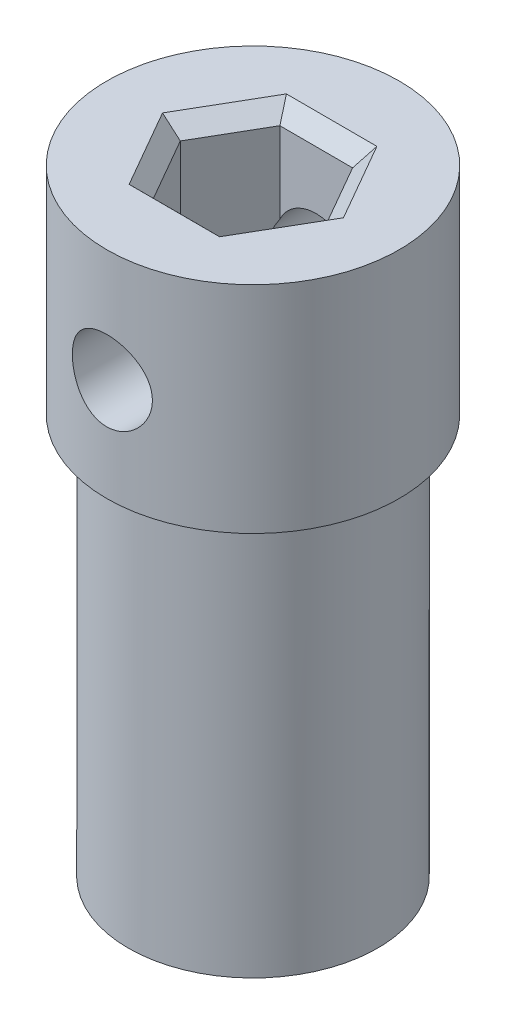
ISO-10303-21;
HEADER;
FILE_DESCRIPTION(('STEP AP214'),'2;1');
FILE_NAME('part.step','',(''),(''),'','','');
FILE_SCHEMA(('AUTOMOTIVE_DESIGN { 1 0 10303 214 1 1 1 1 }'));
ENDSEC;
DATA;
#1=APPLICATION_CONTEXT('core data for automotive mechanical design processes');
#2=APPLICATION_PROTOCOL_DEFINITION('international standard','automotive_design',2000,#1);
#3=PRODUCT_CONTEXT('',#1,'mechanical');
#4=PRODUCT('Part','Part','',(#3));
#5=PRODUCT_RELATED_PRODUCT_CATEGORY('part','',(#4));
#6=PRODUCT_DEFINITION_FORMATION('','',#4);
#7=PRODUCT_DEFINITION_CONTEXT('part definition',#1,'design');
#8=PRODUCT_DEFINITION('design','',#6,#7);
#9=PRODUCT_DEFINITION_SHAPE('','',#8);
#10=(LENGTH_UNIT() NAMED_UNIT(*) SI_UNIT(.MILLI.,.METRE.));
#11=(NAMED_UNIT(*) PLANE_ANGLE_UNIT() SI_UNIT($,.RADIAN.));
#12=(NAMED_UNIT(*) SI_UNIT($,.STERADIAN.) SOLID_ANGLE_UNIT());
#13=UNCERTAINTY_MEASURE_WITH_UNIT(LENGTH_MEASURE(1.E-05),#10,'distance_accuracy_value','');
#14=(GEOMETRIC_REPRESENTATION_CONTEXT(3) GLOBAL_UNCERTAINTY_ASSIGNED_CONTEXT((#13)) GLOBAL_UNIT_ASSIGNED_CONTEXT((#10,
#11,#12)) REPRESENTATION_CONTEXT('',''));
#15=CARTESIAN_POINT('',(0.,0.,0.));
#16=DIRECTION('',(0.,0.,1.));
#17=DIRECTION('',(1.,0.,0.));
#18=AXIS2_PLACEMENT_3D('',#15,#16,#17);
#19=CARTESIAN_POINT('',(1.18786890623597,20.,-2.04751087785415));
#20=DIRECTION('',(-0.00209924990421611,0.,0.999997796572492));
#21=DIRECTION('',(0.999997796572492,0.,0.00209924990421611));
#22=AXIS2_PLACEMENT_3D('',#19,#20,#21);
#23=PLANE('',#22);
#24=CARTESIAN_POINT('',(0.,16.3191525657327,-2.05000451703634));
#25=DIRECTION('',(-0.00209924990421611,0.,0.999997796572492));
#26=DIRECTION('',(-0.999997796572492,0.,-0.00209924990421611));
#27=AXIS2_PLACEMENT_3D('',#24,#25,#26);
#28=ELLIPSE('',#27,1.30000286446207,1.3);
#29=CARTESIAN_POINT('',(-1.17926198162869,15.7720317576059,-2.05248008809306));
#30=VERTEX_POINT('',#29);
#31=CARTESIAN_POINT('',(1.18786890623597,15.7909788617321,-2.04751087785415));
#32=VERTEX_POINT('',#31);
#33=EDGE_CURVE('E292',#30,#32,#28,.T.);
#34=ORIENTED_EDGE('',*,*,#33,.F.);
#35=DIRECTION('',(0.,-1.,0.));
#36=VECTOR('',#35,1.);
#37=CARTESIAN_POINT('',(-1.17926198162869,20.,-2.05248008809306));
#38=LINE('',#37,#36);
#39=CARTESIAN_POINT('',(-1.17926198162869,5.,-2.05248008809306));
#40=VERTEX_POINT('',#39);
#41=EDGE_CURVE('E180',#30,#40,#38,.T.);
#42=ORIENTED_EDGE('',*,*,#41,.T.);
#43=DIRECTION('',(-0.999997796572492,0.,-0.00209924990421611));
#44=VECTOR('',#43,1.);
#45=CARTESIAN_POINT('',(0.00430346230364303,5.,-2.04999548297361));
#46=LINE('',#45,#44);
#47=CARTESIAN_POINT('',(1.18786890623597,5.,-2.04751087785415));
#48=VERTEX_POINT('',#47);
#49=EDGE_CURVE('E171',#48,#40,#46,.T.);
#50=ORIENTED_EDGE('',*,*,#49,.F.);
#51=DIRECTION('',(0.,-1.,0.));
#52=VECTOR('',#51,1.);
#53=CARTESIAN_POINT('',(1.18786890623597,20.,-2.04751087785415));
#54=LINE('',#53,#52);
#55=EDGE_CURVE('E184',#32,#48,#54,.T.);
#56=ORIENTED_EDGE('',*,*,#55,.F.);
#57=EDGE_LOOP('',(#34,#42,#50,#56));
#58=FACE_BOUND('',#57,.T.);
#59=ADVANCED_FACE('F47',(#58),#23,.T.);
#60=CARTESIAN_POINT('',(-1.18786890623597,20.,2.04751087785415));
#61=DIRECTION('',(0.00209924990421593,0.,-0.999997796572492));
#62=DIRECTION('',(-0.999997796572492,0.,-0.00209924990421593));
#63=AXIS2_PLACEMENT_3D('',#60,#61,#62);
#64=PLANE('',#63);
#65=CARTESIAN_POINT('',(0.,16.3191525657327,2.05000451703634));
#66=DIRECTION('',(0.00209924990421593,0.,-0.999997796572492));
#67=DIRECTION('',(-0.999997796572492,0.,-0.00209924990421593));
#68=AXIS2_PLACEMENT_3D('',#65,#66,#67);
#69=ELLIPSE('',#68,1.30000286446207,1.3);
#70=CARTESIAN_POINT('',(-1.18786890623597,16.8473262697334,2.04751087785415));
#71=VERTEX_POINT('',#70);
#72=CARTESIAN_POINT('',(1.17926198162869,16.8662733738592,2.05248008809306));
#73=VERTEX_POINT('',#72);
#74=EDGE_CURVE('E76',#71,#73,#69,.T.);
#75=ORIENTED_EDGE('',*,*,#74,.F.);
#76=DIRECTION('',(0.,-1.,0.));
#77=VECTOR('',#76,1.);
#78=CARTESIAN_POINT('',(-1.18786890623597,20.,2.04751087785415));
#79=LINE('',#78,#77);
#80=CARTESIAN_POINT('',(-1.18786890623597,19.5,2.04751087785415));
#81=VERTEX_POINT('',#80);
#82=EDGE_CURVE('E175',#81,#71,#79,.T.);
#83=ORIENTED_EDGE('',*,*,#82,.F.);
#84=DIRECTION('',(0.999997796572492,0.,0.00209924990421593));
#85=VECTOR('',#84,1.);
#86=CARTESIAN_POINT('',(-1.18786890623597,19.5,2.04751087785415));
#87=LINE('',#86,#85);
#88=CARTESIAN_POINT('',(1.17926198162869,19.5,2.05248008809306));
#89=VERTEX_POINT('',#88);
#90=EDGE_CURVE('E207',#81,#89,#87,.T.);
#91=ORIENTED_EDGE('',*,*,#90,.T.);
#92=DIRECTION('',(0.,-1.,0.));
#93=VECTOR('',#92,1.);
#94=CARTESIAN_POINT('',(1.17926198162869,20.,2.05248008809306));
#95=LINE('',#94,#93);
#96=EDGE_CURVE('E168',#89,#73,#95,.T.);
#97=ORIENTED_EDGE('',*,*,#96,.T.);
#98=EDGE_LOOP('',(#75,#83,#91,#97));
#99=FACE_BOUND('',#98,.T.);
#100=ADVANCED_FACE('F265',(#99),#64,.T.);
#101=CARTESIAN_POINT('',(2.36713088786466,20.,0.00496921023891099));
#102=DIRECTION('',(-0.867073120512349,0.,0.498180894540304));
#103=DIRECTION('',(0.498180894540304,0.,0.867073120512349));
#104=AXIS2_PLACEMENT_3D('',#101,#102,#103);
#105=PLANE('',#104);
#106=CARTESIAN_POINT('',(0.,16.3191525657327,-4.11497113290881));
#107=DIRECTION('',(-0.867073120512349,0.,0.498180894540304));
#108=DIRECTION('',(-0.498180894540304,0.,-0.867073120512349));
#109=AXIS2_PLACEMENT_3D('',#106,#107,#108);
#110=ELLIPSE('',#109,2.60949388916164,1.3);
#111=CARTESIAN_POINT('',(1.18786890623597,16.8473262697332,-2.04751087785415));
#112=VERTEX_POINT('',#111);
#113=EDGE_CURVE('E220',#32,#112,#110,.T.);
#114=ORIENTED_EDGE('',*,*,#113,.F.);
#115=ORIENTED_EDGE('',*,*,#55,.T.);
#116=DIRECTION('',(-0.498180894540304,0.,-0.867073120512349));
#117=VECTOR('',#116,1.);
#118=CARTESIAN_POINT('',(1.77749989705032,5.,-1.02127083380762));
#119=LINE('',#118,#117);
#120=CARTESIAN_POINT('',(2.36713088786466,5.,0.00496921023891077));
#121=VERTEX_POINT('',#120);
#122=EDGE_CURVE('E330',#121,#48,#119,.T.);
#123=ORIENTED_EDGE('',*,*,#122,.F.);
#124=DIRECTION('',(0.,-1.,0.));
#125=VECTOR('',#124,1.);
#126=CARTESIAN_POINT('',(2.36713088786466,20.,0.00496921023891099));
#127=LINE('',#126,#125);
#128=CARTESIAN_POINT('',(2.36713088786466,19.5,0.00496921023891099));
#129=VERTEX_POINT('',#128);
#130=EDGE_CURVE('E169',#129,#121,#127,.T.);
#131=ORIENTED_EDGE('',*,*,#130,.F.);
#132=DIRECTION('',(-0.498180894540304,0.,-0.867073120512349));
#133=VECTOR('',#132,1.);
#134=CARTESIAN_POINT('',(2.36713088786466,19.5,0.00496921023891099));
#135=LINE('',#134,#133);
#136=CARTESIAN_POINT('',(1.18786890623597,19.5,-2.04751087785415));
#137=VERTEX_POINT('',#136);
#138=EDGE_CURVE('E213',#129,#137,#135,.T.);
#139=ORIENTED_EDGE('',*,*,#138,.T.);
#140=EDGE_CURVE('E185',#137,#112,#54,.T.);
#141=ORIENTED_EDGE('',*,*,#140,.T.);
#142=EDGE_LOOP('',(#114,#115,#123,#131,#139,#141));
#143=FACE_BOUND('',#142,.T.);
#144=ADVANCED_FACE('F273',(#143),#105,.T.);
#145=CARTESIAN_POINT('',(-1.17926198162869,16.8662733738594,-2.05248008809306));
#146=VERTEX_POINT('',#145);
#147=EDGE_CURVE('E68',#112,#146,#28,.T.);
#148=ORIENTED_EDGE('',*,*,#147,.F.);
#149=ORIENTED_EDGE('',*,*,#140,.F.);
#150=DIRECTION('',(-0.999997796572492,0.,-0.00209924990421611));
#151=VECTOR('',#150,1.);
#152=CARTESIAN_POINT('',(1.18786890623597,19.5,-2.04751087785415));
#153=LINE('',#152,#151);
#154=CARTESIAN_POINT('',(-1.17926198162869,19.5,-2.05248008809306));
#155=VERTEX_POINT('',#154);
#156=EDGE_CURVE('E215',#137,#155,#153,.T.);
#157=ORIENTED_EDGE('',*,*,#156,.T.);
#158=EDGE_CURVE('E181',#155,#146,#38,.T.);
#159=ORIENTED_EDGE('',*,*,#158,.T.);
#160=EDGE_LOOP('',(#148,#149,#157,#159));
#161=FACE_BOUND('',#160,.T.);
#162=ADVANCED_FACE('F268',(#161),#23,.T.);
#163=CARTESIAN_POINT('',(-1.17926198162869,20.,-2.05248008809306));
#164=DIRECTION('',(0.864973870608133,0.,0.50181690203219));
#165=DIRECTION('',(0.50181690203219,0.,-0.864973870608133));
#166=AXIS2_PLACEMENT_3D('',#163,#164,#165);
#167=PLANE('',#166);
#168=CARTESIAN_POINT('',(0.,16.3191525657327,-4.08515534590038));
#169=DIRECTION('',(0.864973870608133,0.,0.50181690203219));
#170=DIRECTION('',(0.50181690203219,0.,-0.864973870608133));
#171=AXIS2_PLACEMENT_3D('',#168,#169,#170);
#172=ELLIPSE('',#171,2.59058631691248,1.3);
#173=EDGE_CURVE('E293',#146,#30,#172,.T.);
#174=ORIENTED_EDGE('',*,*,#173,.F.);
#175=ORIENTED_EDGE('',*,*,#158,.F.);
#176=DIRECTION('',(-0.50181690203219,0.,0.864973870608133));
#177=VECTOR('',#176,1.);
#178=CARTESIAN_POINT('',(-1.17926198162869,19.5,-2.05248008809306));
#179=LINE('',#178,#177);
#180=CARTESIAN_POINT('',(-2.36713088786466,19.5,-0.00496921023891142));
#181=VERTEX_POINT('',#180);
#182=EDGE_CURVE('E209',#155,#181,#179,.T.);
#183=ORIENTED_EDGE('',*,*,#182,.T.);
#184=DIRECTION('',(0.,-1.,0.));
#185=VECTOR('',#184,1.);
#186=CARTESIAN_POINT('',(-2.36713088786466,20.,-0.00496921023891142));
#187=LINE('',#186,#185);
#188=CARTESIAN_POINT('',(-2.36713088786466,5.,-0.00496921023891142));
#189=VERTEX_POINT('',#188);
#190=EDGE_CURVE('E178',#181,#189,#187,.T.);
#191=ORIENTED_EDGE('',*,*,#190,.T.);
#192=DIRECTION('',(-0.50181690203219,0.,0.864973870608134));
#193=VECTOR('',#192,1.);
#194=CARTESIAN_POINT('',(-1.77319643474667,5.,-1.02872464916599));
#195=LINE('',#194,#193);
#196=EDGE_CURVE('E344',#40,#189,#195,.T.);
#197=ORIENTED_EDGE('',*,*,#196,.F.);
#198=ORIENTED_EDGE('',*,*,#41,.F.);
#199=EDGE_LOOP('',(#174,#175,#183,#191,#197,#198));
#200=FACE_BOUND('',#199,.T.);
#201=ADVANCED_FACE('F280',(#200),#167,.T.);
#202=CARTESIAN_POINT('',(-2.36713088786466,20.,-0.00496921023891142));
#203=DIRECTION('',(0.867073120512349,0.,-0.498180894540304));
#204=DIRECTION('',(-0.498180894540304,0.,-0.867073120512349));
#205=AXIS2_PLACEMENT_3D('',#202,#203,#204);
#206=PLANE('',#205);
#207=CARTESIAN_POINT('',(0.,16.3191525657327,4.11497113290866));
#208=DIRECTION('',(0.867073120512349,0.,-0.498180894540304));
#209=DIRECTION('',(-0.498180894540304,0.,-0.867073120512349));
#210=AXIS2_PLACEMENT_3D('',#207,#208,#209);
#211=ELLIPSE('',#210,2.60949388916164,1.3);
#212=CARTESIAN_POINT('',(-1.18786890623597,15.7909788617319,2.04751087785415));
#213=VERTEX_POINT('',#212);
#214=EDGE_CURVE('E322',#213,#71,#211,.T.);
#215=ORIENTED_EDGE('',*,*,#214,.F.);
#216=CARTESIAN_POINT('',(-1.18786890623597,5.,2.04751087785415));
#217=VERTEX_POINT('',#216);
#218=EDGE_CURVE('E162',#213,#217,#79,.T.);
#219=ORIENTED_EDGE('',*,*,#218,.T.);
#220=DIRECTION('',(0.498180894540304,0.,0.867073120512349));
#221=VECTOR('',#220,1.);
#222=CARTESIAN_POINT('',(-1.77749989705032,5.,1.02127083380762));
#223=LINE('',#222,#221);
#224=EDGE_CURVE('E341',#189,#217,#223,.T.);
#225=ORIENTED_EDGE('',*,*,#224,.F.);
#226=ORIENTED_EDGE('',*,*,#190,.F.);
#227=DIRECTION('',(0.498180894540304,0.,0.867073120512349));
#228=VECTOR('',#227,1.);
#229=CARTESIAN_POINT('',(-2.36713088786466,19.5,-0.00496921023891142));
#230=LINE('',#229,#228);
#231=EDGE_CURVE('E191',#181,#81,#230,.T.);
#232=ORIENTED_EDGE('',*,*,#231,.T.);
#233=ORIENTED_EDGE('',*,*,#82,.T.);
#234=EDGE_LOOP('',(#215,#219,#225,#226,#232,#233));
#235=FACE_BOUND('',#234,.T.);
#236=ADVANCED_FACE('F286',(#235),#206,.T.);
#237=CARTESIAN_POINT('',(1.17926198162869,15.7720317576061,2.05248008809306));
#238=VERTEX_POINT('',#237);
#239=EDGE_CURVE('E149',#238,#213,#69,.T.);
#240=ORIENTED_EDGE('',*,*,#239,.F.);
#241=CARTESIAN_POINT('',(1.17926198162869,5.,2.05248008809306));
#242=VERTEX_POINT('',#241);
#243=EDGE_CURVE('E160',#238,#242,#95,.T.);
#244=ORIENTED_EDGE('',*,*,#243,.T.);
#245=DIRECTION('',(0.999997796572492,0.,0.00209924990421593));
#246=VECTOR('',#245,1.);
#247=CARTESIAN_POINT('',(-0.00430346230364265,5.,2.04999548297361));
#248=LINE('',#247,#246);
#249=EDGE_CURVE('E339',#217,#242,#248,.T.);
#250=ORIENTED_EDGE('',*,*,#249,.F.);
#251=ORIENTED_EDGE('',*,*,#218,.F.);
#252=EDGE_LOOP('',(#240,#244,#250,#251));
#253=FACE_BOUND('',#252,.T.);
#254=ADVANCED_FACE('F158',(#253),#64,.T.);
#255=CARTESIAN_POINT('',(1.17926198162869,20.,2.05248008809306));
#256=DIRECTION('',(-0.864973870608134,0.,-0.501816902032189));
#257=DIRECTION('',(-0.501816902032189,0.,0.864973870608134));
#258=AXIS2_PLACEMENT_3D('',#255,#256,#257);
#259=PLANE('',#258);
#260=CARTESIAN_POINT('',(0.,16.3191525657327,4.08515534590052));
#261=DIRECTION('',(-0.864973870608134,0.,-0.501816902032189));
#262=DIRECTION('',(0.501816902032189,0.,-0.864973870608134));
#263=AXIS2_PLACEMENT_3D('',#260,#261,#262);
#264=ELLIPSE('',#263,2.59058631691248,1.3);
#265=EDGE_CURVE('E145',#73,#238,#264,.T.);
#266=ORIENTED_EDGE('',*,*,#265,.F.);
#267=ORIENTED_EDGE('',*,*,#96,.F.);
#268=DIRECTION('',(0.501816902032189,0.,-0.864973870608134));
#269=VECTOR('',#268,1.);
#270=CARTESIAN_POINT('',(1.17926198162869,19.5,2.05248008809306));
#271=LINE('',#270,#269);
#272=EDGE_CURVE('E211',#89,#129,#271,.T.);
#273=ORIENTED_EDGE('',*,*,#272,.T.);
#274=ORIENTED_EDGE('',*,*,#130,.T.);
#275=DIRECTION('',(0.501816902032189,0.,-0.864973870608134));
#276=VECTOR('',#275,1.);
#277=CARTESIAN_POINT('',(1.77319643474667,5.,1.02872464916599));
#278=LINE('',#277,#276);
#279=EDGE_CURVE('E167',#242,#121,#278,.T.);
#280=ORIENTED_EDGE('',*,*,#279,.F.);
#281=ORIENTED_EDGE('',*,*,#243,.F.);
#282=EDGE_LOOP('',(#266,#267,#273,#274,#280,#281));
#283=FACE_BOUND('',#282,.T.);
#284=ADVANCED_FACE('F165',(#283),#259,.T.);
#285=CARTESIAN_POINT('',(0.,20.,0.));
#286=DIRECTION('',(0.,1.,0.));
#287=DIRECTION('',(0.,0.,1.));
#288=AXIS2_PLACEMENT_3D('',#285,#286,#287);
#289=PLANE('',#288);
#290=DIRECTION('',(-0.999997796572492,0.,-0.00209924990421593));
#291=VECTOR('',#290,1.);
#292=CARTESIAN_POINT('',(-0.00535308725575063,20.,2.54999438125986));
#293=LINE('',#292,#291);
#294=CARTESIAN_POINT('',(1.46688685519667,20.,2.55308498762797));
#295=VERTEX_POINT('',#294);
#296=CARTESIAN_POINT('',(-1.47759302970817,20.,2.54690377489176));
#297=VERTEX_POINT('',#296);
#298=EDGE_CURVE('E202',#295,#297,#293,.T.);
#299=ORIENTED_EDGE('',*,*,#298,.T.);
#300=DIRECTION('',(-0.498180894540304,0.,-0.867073120512349));
#301=VECTOR('',#300,1.);
#302=CARTESIAN_POINT('',(-2.2110364573065,20.,1.27036128107778));
#303=LINE('',#302,#301);
#304=CARTESIAN_POINT('',(-2.94447988490483,20.,-0.00618121273620792));
#305=VERTEX_POINT('',#304);
#306=EDGE_CURVE('E204',#297,#305,#303,.T.);
#307=ORIENTED_EDGE('',*,*,#306,.T.);
#308=DIRECTION('',(0.50181690203219,0.,-0.864973870608133));
#309=VECTOR('',#308,1.);
#310=CARTESIAN_POINT('',(-2.20568337005075,20.,-1.27963310018209));
#311=LINE('',#310,#309);
#312=CARTESIAN_POINT('',(-1.46688685519667,20.,-2.55308498762797));
#313=VERTEX_POINT('',#312);
#314=EDGE_CURVE('E200',#305,#313,#311,.T.);
#315=ORIENTED_EDGE('',*,*,#314,.T.);
#316=DIRECTION('',(0.999997796572492,0.,0.00209924990421611));
#317=VECTOR('',#316,1.);
#318=CARTESIAN_POINT('',(0.0053530872557511,20.,-2.54999438125986));
#319=LINE('',#318,#317);
#320=CARTESIAN_POINT('',(1.47759302970817,20.,-2.54690377489176));
#321=VERTEX_POINT('',#320);
#322=EDGE_CURVE('E194',#313,#321,#319,.T.);
#323=ORIENTED_EDGE('',*,*,#322,.T.);
#324=DIRECTION('',(0.498180894540304,0.,0.867073120512349));
#325=VECTOR('',#324,1.);
#326=CARTESIAN_POINT('',(2.2110364573065,20.,-1.27036128107778));
#327=LINE('',#326,#325);
#328=CARTESIAN_POINT('',(2.94447988490483,20.,0.00618121273620698));
#329=VERTEX_POINT('',#328);
#330=EDGE_CURVE('E196',#321,#329,#327,.T.);
#331=ORIENTED_EDGE('',*,*,#330,.T.);
#332=DIRECTION('',(-0.501816902032189,0.,0.864973870608134));
#333=VECTOR('',#332,1.);
#334=CARTESIAN_POINT('',(2.20568337005075,20.,1.27963310018209));
#335=LINE('',#334,#333);
#336=EDGE_CURVE('E198',#329,#295,#335,.T.);
#337=ORIENTED_EDGE('',*,*,#336,.T.);
#338=EDGE_LOOP('',(#299,#307,#315,#323,#331,#337));
#339=FACE_BOUND('',#338,.T.);
#340=CARTESIAN_POINT('',(0.,20.,0.));
#341=DIRECTION('',(0.,1.,0.));
#342=DIRECTION('',(0.,0.,1.));
#343=AXIS2_PLACEMENT_3D('',#340,#341,#342);
#344=CIRCLE('',#343,4.75);
#345=CARTESIAN_POINT('',(0.,20.,4.75));
#346=VERTEX_POINT('',#345);
#347=EDGE_CURVE('E233',#346,#346,#344,.F.);
#348=ORIENTED_EDGE('',*,*,#347,.F.);
#349=EDGE_LOOP('',(#348));
#350=FACE_BOUND('',#349,.T.);
#351=ADVANCED_FACE('F311',(#339,#350),#289,.T.);
#352=CARTESIAN_POINT('',(0.,5.,0.));
#353=DIRECTION('',(0.,-1.,0.));
#354=DIRECTION('',(0.,0.,-1.));
#355=AXIS2_PLACEMENT_3D('',#352,#353,#354);
#356=PLANE('',#355);
#357=ORIENTED_EDGE('',*,*,#122,.T.);
#358=ORIENTED_EDGE('',*,*,#49,.T.);
#359=ORIENTED_EDGE('',*,*,#196,.T.);
#360=ORIENTED_EDGE('',*,*,#224,.T.);
#361=ORIENTED_EDGE('',*,*,#249,.T.);
#362=ORIENTED_EDGE('',*,*,#279,.T.);
#363=EDGE_LOOP('',(#357,#358,#359,#360,#361,#362));
#364=FACE_BOUND('',#363,.T.);
#365=ADVANCED_FACE('F260',(#364),#356,.F.);
#366=CARTESIAN_POINT('',(0.,33.4350288425444,0.));
#367=DIRECTION('',(0.,-1.,0.));
#368=DIRECTION('',(0.,0.,-1.));
#369=AXIS2_PLACEMENT_3D('',#366,#367,#368);
#370=CYLINDRICAL_SURFACE('',#369,4.75);
#371=CARTESIAN_POINT('',(0.,15.0191525657327,4.75));
#372=CARTESIAN_POINT('',(0.0715951003584682,15.0191541153011,4.74999899440994));
#373=CARTESIAN_POINT('',(0.143206537717279,15.0250868089565,4.74836546774173));
#374=CARTESIAN_POINT('',(0.284361914079167,15.048615970725,4.74200782452498));
#375=CARTESIAN_POINT('',(0.353904920890683,15.0662176169594,4.7372823359242));
#376=CARTESIAN_POINT('',(0.488865863752297,15.1124661183561,4.72526158229014));
#377=CARTESIAN_POINT('',(0.554289142292481,15.1410983109154,4.71796972976162));
#378=CARTESIAN_POINT('',(0.679405453502896,15.2085396003838,4.7015842748338));
#379=CARTESIAN_POINT('',(0.739098023693319,15.2473495177144,4.69249052719904));
#380=CARTESIAN_POINT('',(0.852509735939152,15.3350404564927,4.67323349477973));
#381=CARTESIAN_POINT('',(0.906069718621598,15.3841231407949,4.66305117109811));
#382=CARTESIAN_POINT('',(1.00431011989641,15.4905355201862,4.64288504590069));
#383=CARTESIAN_POINT('',(1.04898932960238,15.5478663362155,4.63290127157846));
#384=CARTESIAN_POINT('',(1.1289881717719,15.6704332715712,4.61406659652621));
#385=CARTESIAN_POINT('',(1.16412246881579,15.7357943785959,4.60523964721438));
#386=CARTESIAN_POINT('',(1.22283955196175,15.8717768820564,4.58999892053115));
#387=CARTESIAN_POINT('',(1.24642459490571,15.9423972476698,4.58358467175034));
#388=CARTESIAN_POINT('',(1.28081663959482,16.0851257171666,4.57409253234305));
#389=CARTESIAN_POINT('',(1.29191322126778,16.1571588999447,4.57093917601155));
#390=CARTESIAN_POINT('',(1.30191648215987,16.3021281584736,4.56810057125313));
#391=CARTESIAN_POINT('',(1.30082557129907,16.3750640528756,4.56841463718784));
#392=CARTESIAN_POINT('',(1.28671421367188,16.5174896160399,4.57240798168314));
#393=CARTESIAN_POINT('',(1.27404658503496,16.5870174797495,4.57598772797946));
#394=CARTESIAN_POINT('',(1.23770745870347,16.7229212005909,4.58594938346629));
#395=CARTESIAN_POINT('',(1.21403503985192,16.7892967933487,4.59233152722927));
#396=CARTESIAN_POINT('',(1.15607648350299,16.917919968221,4.60726473432184));
#397=CARTESIAN_POINT('',(1.12166854684569,16.9801096806638,4.61584047283149));
#398=CARTESIAN_POINT('',(1.04330056314014,17.0979554147175,4.63418162186477));
#399=CARTESIAN_POINT('',(0.99933854590106,17.1536100850557,4.64394727758393));
#400=CARTESIAN_POINT('',(0.901316726901487,17.2588188814548,4.66398009787052));
#401=CARTESIAN_POINT('',(0.846961318710026,17.308096916348,4.67425295164488));
#402=CARTESIAN_POINT('',(0.730631864203716,17.3968963263787,4.69384182527964));
#403=CARTESIAN_POINT('',(0.668657485256591,17.4364172753104,4.70315780333174));
#404=CARTESIAN_POINT('',(0.538406899675957,17.5047112704396,4.71984573129678));
#405=CARTESIAN_POINT('',(0.470102014630273,17.5334320938325,4.72720818597995));
#406=CARTESIAN_POINT('',(0.329385290712426,17.578902150229,4.73909098809721));
#407=CARTESIAN_POINT('',(0.256974402941992,17.5956541435272,4.74361199080819));
#408=CARTESIAN_POINT('',(0.112455507060578,17.6162722768452,4.74920247292855));
#409=CARTESIAN_POINT('',(0.0404048200082267,17.6205135324254,4.75037239727299));
#410=CARTESIAN_POINT('',(-0.103379144914037,17.6170288399728,4.74941887594665));
#411=CARTESIAN_POINT('',(-0.175112456620315,17.6093042000753,4.74729579027414));
#412=CARTESIAN_POINT('',(-0.314871076949878,17.5824138988914,4.74005987984794));
#413=CARTESIAN_POINT('',(-0.382940152351009,17.5634594735669,4.73500228950889));
#414=CARTESIAN_POINT('',(-0.514924300836631,17.5148947197124,4.72247303032738));
#415=CARTESIAN_POINT('',(-0.578838911066989,17.4852832062572,4.71500109305138));
#416=CARTESIAN_POINT('',(-0.702141923591819,17.4155625669063,4.69823904122434));
#417=CARTESIAN_POINT('',(-0.761411711280475,17.3752520281184,4.68891501303483));
#418=CARTESIAN_POINT('',(-0.872476630564392,17.2855290332981,4.6695255028463));
#419=CARTESIAN_POINT('',(-0.924270200395693,17.2361146803941,4.65945986658853));
#420=CARTESIAN_POINT('',(-1.02050795705685,17.1278330474972,4.63934867361868));
#421=CARTESIAN_POINT('',(-1.0646869213105,17.0687278174159,4.6293126668116));
#422=CARTESIAN_POINT('',(-1.14250771994196,16.9437286214798,4.61072476911711));
#423=CARTESIAN_POINT('',(-1.17614997265281,16.8778349252817,4.60217281931504));
#424=CARTESIAN_POINT('',(-1.23169061965019,16.7414410919005,4.58762063029747));
#425=CARTESIAN_POINT('',(-1.2536553906961,16.6709696023547,4.58160600973182));
#426=CARTESIAN_POINT('',(-1.28536406327468,16.5271392573441,4.57281260843628));
#427=CARTESIAN_POINT('',(-1.295111293101,16.4537811938566,4.57003294645611));
#428=CARTESIAN_POINT('',(-1.30190937016433,16.3089830618886,4.56810054957139));
#429=CARTESIAN_POINT('',(-1.29938763462395,16.2375643973341,4.56882571029196));
#430=CARTESIAN_POINT('',(-1.28271663157227,16.0962123142462,4.57353380900221));
#431=CARTESIAN_POINT('',(-1.26856769416037,16.0262788536052,4.57751665450532));
#432=CARTESIAN_POINT('',(-1.22929772094044,15.8904525069768,4.58821673046088));
#433=CARTESIAN_POINT('',(-1.20427180901376,15.824530115881,4.59491022126172));
#434=CARTESIAN_POINT('',(-1.14403192755671,15.6977689396739,4.61027687969974));
#435=CARTESIAN_POINT('',(-1.10881628339131,15.6369309922873,4.61895037269155));
#436=CARTESIAN_POINT('',(-1.02792053161027,15.5200367558106,4.63763415296583));
#437=CARTESIAN_POINT('',(-0.981950946367112,15.464186051045,4.64767744149082));
#438=CARTESIAN_POINT('',(-0.881396780304759,15.3608526217622,4.66779008554348));
#439=CARTESIAN_POINT('',(-0.826810082526995,15.3133719595894,4.67785944687695));
#440=CARTESIAN_POINT('',(-0.709063460062277,15.2270544437435,4.69716556994259));
#441=CARTESIAN_POINT('',(-0.645735853814162,15.1884403978401,4.70637798882931));
#442=CARTESIAN_POINT('',(-0.513236994525068,15.1224666275332,4.72266130243398));
#443=CARTESIAN_POINT('',(-0.444069324085395,15.0951000629382,4.72973349804341));
#444=CARTESIAN_POINT('',(-0.31268558688025,15.0557470341646,4.74008364222336));
#445=CARTESIAN_POINT('',(-0.251007090363235,15.0420570006412,4.74377447109986));
#446=CARTESIAN_POINT('',(-0.126223189317632,15.0237595854062,4.748732959314));
#447=CARTESIAN_POINT('',(-0.063117943308976,15.0191511996396,4.75000088652402));
#448=CARTESIAN_POINT('',(0.,15.0191525657327,4.75));
#449=B_SPLINE_CURVE_WITH_KNOTS('',3,(#371,#372,#373,#374,#375,#376,#377,#378,#379,#380,#381,
#382,#383,#384,#385,#386,#387,#388,#389,#390,#391,#392,#393,#394,#395,#396,#397,#398,#399,#400,
#401,#402,#403,#404,#405,#406,#407,#408,#409,#410,#411,#412,#413,#414,#415,#416,#417,#418,#419,
#420,#421,#422,#423,#424,#425,#426,#427,#428,#429,#430,#431,#432,#433,#434,#435,#436,#437,#438,
#439,#440,#441,#442,#443,#444,#445,#446,#447,#448),.UNSPECIFIED.,.T.,.F.,(4,2,2,2,2,2,2,2,2,2,2,
2,2,2,2,2,2,2,2,2,2,2,2,2,2,2,2,2,2,2,2,2,2,2,2,2,2,2,4),(0.,0.214553756688464,
0.429202785825955,0.643567466942959,0.857949433208487,1.0770191770696,1.29611872119019,
1.51920969740667,1.74225706196029,1.96001843669451,2.17773675267682,2.38903333215547,
2.60034760141902,2.81415229883656,3.0280011278091,3.24921438650876,3.47043730646332,
3.6927165751415,3.91494456441531,4.13043803387268,4.34590794682475,4.55744802377737,
4.76901162841968,4.98488167425051,5.20079674975647,5.42315056701215,5.6454955551614,
5.86656280611601,6.08756982099399,6.30093382834366,6.51429177844098,6.72582022678132,
6.93738345860129,7.15547761247439,7.37362542897072,7.59676812915135,7.81977492286229,
8.00894553984856,8.19809524120503),.UNSPECIFIED.);
#450=CARTESIAN_POINT('',(0.,15.0191525657327,4.75));
#451=VERTEX_POINT('',#450);
#452=EDGE_CURVE('E11',#451,#451,#449,.T.);
#453=ORIENTED_EDGE('',*,*,#452,.F.);
#454=EDGE_LOOP('',(#453));
#455=FACE_BOUND('',#454,.T.);
#456=CARTESIAN_POINT('',(0.,17.6191525657327,-4.75));
#457=CARTESIAN_POINT('',(0.0715951003584682,17.6191510161642,-4.74999899440994));
#458=CARTESIAN_POINT('',(0.143206537717279,17.6132183225089,-4.74836546774173));
#459=CARTESIAN_POINT('',(0.284361914079166,17.5896891607403,-4.74200782452498));
#460=CARTESIAN_POINT('',(0.353904920890683,17.5720875145059,-4.7372823359242));
#461=CARTESIAN_POINT('',(0.488865863752298,17.5258390131093,-4.72526158229014));
#462=CARTESIAN_POINT('',(0.554289142292483,17.4972068205499,-4.71796972976162));
#463=CARTESIAN_POINT('',(0.679405453502898,17.4297655310815,-4.7015842748338));
#464=CARTESIAN_POINT('',(0.73909802369332,17.3909556137509,-4.69249052719904));
#465=CARTESIAN_POINT('',(0.852509735939154,17.3032646749726,-4.67323349477973));
#466=CARTESIAN_POINT('',(0.9060697186216,17.2541819906704,-4.66305117109811));
#467=CARTESIAN_POINT('',(1.00431011989641,17.1477696112791,-4.64288504590069));
#468=CARTESIAN_POINT('',(1.04898932960238,17.0904387952498,-4.63290127157847));
#469=CARTESIAN_POINT('',(1.1289881717719,16.9678718598942,-4.61406659652621));
#470=CARTESIAN_POINT('',(1.16412246881579,16.9025107528695,-4.60523964721438));
#471=CARTESIAN_POINT('',(1.22283955196175,16.7665282494089,-4.58999892053115));
#472=CARTESIAN_POINT('',(1.24642459490571,16.6959078837956,-4.58358467175034));
#473=CARTESIAN_POINT('',(1.28081663959482,16.5531794142987,-4.57409253234305));
#474=CARTESIAN_POINT('',(1.29191322126778,16.4811462315206,-4.57093917601155));
#475=CARTESIAN_POINT('',(1.30191648215987,16.3361769729918,-4.56810057125313));
#476=CARTESIAN_POINT('',(1.30082557129907,16.2632410785897,-4.56841463718784));
#477=CARTESIAN_POINT('',(1.28671421367188,16.1208155154254,-4.57240798168314));
#478=CARTESIAN_POINT('',(1.27404658503496,16.0512876517158,-4.57598772797945));
#479=CARTESIAN_POINT('',(1.23770745870347,15.9153839308745,-4.58594938346629));
#480=CARTESIAN_POINT('',(1.21403503985192,15.8490083381166,-4.59233152722927));
#481=CARTESIAN_POINT('',(1.15607648350299,15.7203851632443,-4.60726473432184));
#482=CARTESIAN_POINT('',(1.12166854684569,15.6581954508015,-4.61584047283149));
#483=CARTESIAN_POINT('',(1.04330056314014,15.5403497167479,-4.63418162186477));
#484=CARTESIAN_POINT('',(0.999338545901057,15.4846950464096,-4.64394727758393));
#485=CARTESIAN_POINT('',(0.901316726901483,15.3794862500105,-4.66398009787052));
#486=CARTESIAN_POINT('',(0.846961318710021,15.3302082151173,-4.67425295164488));
#487=CARTESIAN_POINT('',(0.730631864203712,15.2414088050866,-4.69384182527964));
#488=CARTESIAN_POINT('',(0.668657485256588,15.2018878561549,-4.70315780333174));
#489=CARTESIAN_POINT('',(0.538406899675955,15.1335938610257,-4.71984573129678));
#490=CARTESIAN_POINT('',(0.470102014630271,15.1048730376328,-4.72720818597995));
#491=CARTESIAN_POINT('',(0.329385290712425,15.0594029812363,-4.73909098809721));
#492=CARTESIAN_POINT('',(0.256974402941993,15.0426509879382,-4.74361199080819));
#493=CARTESIAN_POINT('',(0.11245550706058,15.0220328546201,-4.74920247292855));
#494=CARTESIAN_POINT('',(0.0404048200082283,15.01779159904,-4.75037239727299));
#495=CARTESIAN_POINT('',(-0.103379144914035,15.0212762914925,-4.74941887594665));
#496=CARTESIAN_POINT('',(-0.175112456620315,15.02900093139,-4.74729579027414));
#497=CARTESIAN_POINT('',(-0.314871076949878,15.0558912325739,-4.74005987984794));
#498=CARTESIAN_POINT('',(-0.382940152351009,15.0748456578985,-4.73500228950889));
#499=CARTESIAN_POINT('',(-0.514924300836631,15.1234104117529,-4.72247303032738));
#500=CARTESIAN_POINT('',(-0.578838911066989,15.1530219252082,-4.71500109305138));
#501=CARTESIAN_POINT('',(-0.702141923591819,15.222742564559,-4.69823904122434));
#502=CARTESIAN_POINT('',(-0.761411711280473,15.2630531033469,-4.68891501303483));
#503=CARTESIAN_POINT('',(-0.872476630564391,15.3527760981672,-4.6695255028463));
#504=CARTESIAN_POINT('',(-0.924270200395693,15.4021904510712,-4.65945986658853));
#505=CARTESIAN_POINT('',(-1.02050795705685,15.5104720839681,-4.63934867361868));
#506=CARTESIAN_POINT('',(-1.0646869213105,15.5695773140494,-4.6293126668116));
#507=CARTESIAN_POINT('',(-1.14250771994196,15.6945765099855,-4.61072476911711));
#508=CARTESIAN_POINT('',(-1.17614997265281,15.7604702061837,-4.60217281931504));
#509=CARTESIAN_POINT('',(-1.23169061965019,15.8968640395648,-4.58762063029747));
#510=CARTESIAN_POINT('',(-1.2536553906961,15.9673355291106,-4.58160600973182));
#511=CARTESIAN_POINT('',(-1.28536406327468,16.1111658741212,-4.57281260843628));
#512=CARTESIAN_POINT('',(-1.295111293101,16.1845239376088,-4.57003294645611));
#513=CARTESIAN_POINT('',(-1.30190937016433,16.3293220695768,-4.56810054957139));
#514=CARTESIAN_POINT('',(-1.29938763462395,16.4007407341313,-4.56882571029196));
#515=CARTESIAN_POINT('',(-1.28271663157227,16.5420928172192,-4.57353380900221));
#516=CARTESIAN_POINT('',(-1.26856769416037,16.6120262778601,-4.57751665450532));
#517=CARTESIAN_POINT('',(-1.22929772094044,16.7478526244885,-4.58821673046088));
#518=CARTESIAN_POINT('',(-1.20427180901376,16.8137750155844,-4.59491022126172));
#519=CARTESIAN_POINT('',(-1.14403192755671,16.9405361917914,-4.61027687969974));
#520=CARTESIAN_POINT('',(-1.10881628339131,17.001374139178,-4.61895037269155));
#521=CARTESIAN_POINT('',(-1.02792053161027,17.1182683756547,-4.63763415296583));
#522=CARTESIAN_POINT('',(-0.981950946367111,17.1741190804204,-4.64767744149082));
#523=CARTESIAN_POINT('',(-0.881396780304758,17.2774525097031,-4.66779008554348));
#524=CARTESIAN_POINT('',(-0.826810082526994,17.324933171876,-4.67785944687695));
#525=CARTESIAN_POINT('',(-0.709063460062278,17.4112506877218,-4.69716556994259));
#526=CARTESIAN_POINT('',(-0.645735853814163,17.4498647336252,-4.70637798882931));
#527=CARTESIAN_POINT('',(-0.51323699452507,17.5158385039321,-4.72266130243398));
#528=CARTESIAN_POINT('',(-0.444069324085397,17.5432050685272,-4.72973349804341));
#529=CARTESIAN_POINT('',(-0.312685586880252,17.5825580973007,-4.74008364222336));
#530=CARTESIAN_POINT('',(-0.251007090363238,17.5962481308242,-4.74377447109986));
#531=CARTESIAN_POINT('',(-0.126223189317634,17.6145455460591,-4.748732959314));
#532=CARTESIAN_POINT('',(-0.0631179433089767,17.6191539318258,-4.75000088652402));
#533=CARTESIAN_POINT('',(0.,17.6191525657327,-4.75));
#534=B_SPLINE_CURVE_WITH_KNOTS('',3,(#456,#457,#458,#459,#460,#461,#462,#463,#464,#465,#466,
#467,#468,#469,#470,#471,#472,#473,#474,#475,#476,#477,#478,#479,#480,#481,#482,#483,#484,#485,
#486,#487,#488,#489,#490,#491,#492,#493,#494,#495,#496,#497,#498,#499,#500,#501,#502,#503,#504,
#505,#506,#507,#508,#509,#510,#511,#512,#513,#514,#515,#516,#517,#518,#519,#520,#521,#522,#523,
#524,#525,#526,#527,#528,#529,#530,#531,#532,#533),.UNSPECIFIED.,.T.,.F.,(4,2,2,2,2,2,2,2,2,2,2,
2,2,2,2,2,2,2,2,2,2,2,2,2,2,2,2,2,2,2,2,2,2,2,2,2,2,2,4),(0.,0.214553756688464,
0.429202785825955,0.643567466942962,0.857949433208488,1.0770191770696,1.29611872119019,
1.51920969740667,1.74225706196029,1.96001843669451,2.17773675267682,2.38903333215548,
2.60034760141903,2.81415229883656,3.02800112780911,3.24921438650876,3.47043730646332,
3.6927165751415,3.9149445644153,4.13043803387268,4.34590794682475,4.55744802377737,
4.76901162841968,4.98488167425051,5.20079674975647,5.42315056701214,5.6454955551614,
5.86656280611601,6.08756982099399,6.30093382834366,6.51429177844098,6.72582022678132,
6.93738345860129,7.15547761247439,7.37362542897072,7.59676812915135,7.81977492286229,
8.00894553984856,8.19809524120503),.UNSPECIFIED.);
#535=CARTESIAN_POINT('',(0.,17.6191525657327,-4.75));
#536=VERTEX_POINT('',#535);
#537=EDGE_CURVE('E61',#536,#536,#534,.T.);
#538=ORIENTED_EDGE('',*,*,#537,.F.);
#539=EDGE_LOOP('',(#538));
#540=FACE_BOUND('',#539,.T.);
#541=CARTESIAN_POINT('',(0.,13.,0.));
#542=DIRECTION('',(0.,-1.,0.));
#543=DIRECTION('',(0.,0.,-1.));
#544=AXIS2_PLACEMENT_3D('',#541,#542,#543);
#545=CIRCLE('',#544,4.75);
#546=CARTESIAN_POINT('',(0.,13.,-4.75));
#547=VERTEX_POINT('',#546);
#548=EDGE_CURVE('E327',#547,#547,#545,.T.);
#549=ORIENTED_EDGE('',*,*,#548,.F.);
#550=EDGE_LOOP('',(#549));
#551=FACE_BOUND('',#550,.T.);
#552=ORIENTED_EDGE('',*,*,#347,.T.);
#553=EDGE_LOOP('',(#552));
#554=FACE_BOUND('',#553,.T.);
#555=ADVANCED_FACE('F238',(#455,#540,#551,#554),#370,.T.);
#556=CARTESIAN_POINT('',(0.,13.,0.));
#557=DIRECTION('',(0.,-1.,0.));
#558=DIRECTION('',(0.,0.,-1.));
#559=AXIS2_PLACEMENT_3D('',#556,#557,#558);
#560=PLANE('',#559);
#561=CARTESIAN_POINT('',(0.,13.,0.));
#562=DIRECTION('',(0.,-1.,0.));
#563=DIRECTION('',(0.,0.,-1.));
#564=AXIS2_PLACEMENT_3D('',#561,#562,#563);
#565=CIRCLE('',#564,4.05);
#566=CARTESIAN_POINT('',(0.,13.,-4.05));
#567=VERTEX_POINT('',#566);
#568=EDGE_CURVE('E331',#567,#567,#565,.T.);
#569=ORIENTED_EDGE('',*,*,#568,.F.);
#570=EDGE_LOOP('',(#569));
#571=FACE_BOUND('',#570,.T.);
#572=ORIENTED_EDGE('',*,*,#548,.T.);
#573=EDGE_LOOP('',(#572));
#574=FACE_BOUND('',#573,.T.);
#575=ADVANCED_FACE('F246',(#571,#574),#560,.T.);
#576=CARTESIAN_POINT('',(0.,0.,0.));
#577=DIRECTION('',(0.,1.,0.));
#578=DIRECTION('',(0.,0.,1.));
#579=AXIS2_PLACEMENT_3D('',#576,#577,#578);
#580=PLANE('',#579);
#581=CARTESIAN_POINT('',(0.,0.,0.));
#582=DIRECTION('',(0.,1.,0.));
#583=DIRECTION('',(0.,0.,1.));
#584=AXIS2_PLACEMENT_3D('',#581,#582,#583);
#585=CIRCLE('',#584,4.05);
#586=CARTESIAN_POINT('',(0.,0.,4.05));
#587=VERTEX_POINT('',#586);
#588=EDGE_CURVE('E188',#587,#587,#585,.T.);
#589=ORIENTED_EDGE('',*,*,#588,.F.);
#590=EDGE_LOOP('',(#589));
#591=FACE_BOUND('',#590,.T.);
#592=ADVANCED_FACE('F249',(#591),#580,.F.);
#593=CARTESIAN_POINT('',(0.,20.,0.));
#594=DIRECTION('',(0.,-1.,0.));
#595=DIRECTION('',(0.,0.,-1.));
#596=AXIS2_PLACEMENT_3D('',#593,#594,#595);
#597=CYLINDRICAL_SURFACE('',#596,4.05);
#598=ORIENTED_EDGE('',*,*,#568,.T.);
#599=EDGE_LOOP('',(#598));
#600=FACE_BOUND('',#599,.T.);
#601=ORIENTED_EDGE('',*,*,#588,.T.);
#602=EDGE_LOOP('',(#601));
#603=FACE_BOUND('',#602,.T.);
#604=ADVANCED_FACE('F256',(#600,#603),#597,.T.);
#605=CARTESIAN_POINT('',(2.36713088786466,19.5,0.00496921023891099));
#606=DIRECTION('',(0.613113283298859,-0.707106781186552,-0.352267088787027));
#607=DIRECTION('',(-0.498180894540304,0.,-0.867073120512349));
#608=AXIS2_PLACEMENT_3D('',#605,#606,#607);
#609=PLANE('',#608);
#610=DIRECTION('',(0.755927280383825,0.654653670707973,0.00158688376752409));
#611=VECTOR('',#610,1.);
#612=CARTESIAN_POINT('',(1.69080777704618,18.9142857142857,0.00354943588493561));
#613=LINE('',#612,#611);
#614=EDGE_CURVE('E228',#329,#129,#613,.F.);
#615=ORIENTED_EDGE('',*,*,#614,.F.);
#616=ORIENTED_EDGE('',*,*,#330,.F.);
#617=DIRECTION('',(0.379337921847441,0.654653670707973,-0.653858786342312));
#618=VECTOR('',#617,1.);
#619=CARTESIAN_POINT('',(0.848477790168549,18.9142857142857,-1.46250776989582));
#620=LINE('',#619,#618);
#621=EDGE_CURVE('E231',#137,#321,#620,.T.);
#622=ORIENTED_EDGE('',*,*,#621,.F.);
#623=ORIENTED_EDGE('',*,*,#138,.F.);
#624=EDGE_LOOP('',(#615,#616,#622,#623));
#625=FACE_BOUND('',#624,.T.);
#626=ADVANCED_FACE('F50',(#625),#609,.F.);
#627=CARTESIAN_POINT('',(1.18786890623597,19.5,-2.04751087785415));
#628=DIRECTION('',(0.00148439384267641,-0.707106781186551,-0.707105223128011));
#629=DIRECTION('',(-0.999997796572492,0.,-0.00209924990421611));
#630=AXIS2_PLACEMENT_3D('',#627,#628,#629);
#631=PLANE('',#630);
#632=ORIENTED_EDGE('',*,*,#621,.T.);
#633=ORIENTED_EDGE('',*,*,#322,.F.);
#634=DIRECTION('',(0.376589358536385,-0.654653670707973,0.655445670109836));
#635=VECTOR('',#634,1.);
#636=CARTESIAN_POINT('',(-1.17926198162869,19.5,-2.05248008809306));
#637=LINE('',#636,#635);
#638=EDGE_CURVE('E225',#155,#313,#637,.F.);
#639=ORIENTED_EDGE('',*,*,#638,.F.);
#640=ORIENTED_EDGE('',*,*,#156,.F.);
#641=EDGE_LOOP('',(#632,#633,#639,#640));
#642=FACE_BOUND('',#641,.T.);
#643=ADVANCED_FACE('F316',(#642),#631,.F.);
#644=CARTESIAN_POINT('',(1.17926198162869,19.5,2.05248008809306));
#645=DIRECTION('',(0.611628889456183,-0.707106781186552,0.354838134340984));
#646=DIRECTION('',(0.501816902032189,0.,-0.864973870608134));
#647=AXIS2_PLACEMENT_3D('',#644,#645,#646);
#648=PLANE('',#647);
#649=ORIENTED_EDGE('',*,*,#614,.T.);
#650=ORIENTED_EDGE('',*,*,#272,.F.);
#651=DIRECTION('',(0.376589358536385,0.654653670707973,0.655445670109835));
#652=VECTOR('',#651,1.);
#653=CARTESIAN_POINT('',(0.842329986877629,18.9142857142857,1.46605720578075));
#654=LINE('',#653,#652);
#655=EDGE_CURVE('E222',#295,#89,#654,.F.);
#656=ORIENTED_EDGE('',*,*,#655,.F.);
#657=ORIENTED_EDGE('',*,*,#336,.F.);
#658=EDGE_LOOP('',(#649,#650,#656,#657));
#659=FACE_BOUND('',#658,.T.);
#660=ADVANCED_FACE('F307',(#659),#648,.F.);
#661=CARTESIAN_POINT('',(-1.17926198162869,19.5,-2.05248008809306));
#662=DIRECTION('',(-0.611628889456183,-0.707106781186552,-0.354838134340984));
#663=DIRECTION('',(-0.50181690203219,0.,0.864973870608133));
#664=AXIS2_PLACEMENT_3D('',#661,#662,#663);
#665=PLANE('',#664);
#666=ORIENTED_EDGE('',*,*,#638,.T.);
#667=ORIENTED_EDGE('',*,*,#314,.F.);
#668=DIRECTION('',(0.755927280383825,-0.654653670707973,0.0015868837675244));
#669=VECTOR('',#668,1.);
#670=CARTESIAN_POINT('',(-2.36713088786466,19.5,-0.00496921023891157));
#671=LINE('',#670,#669);
#672=EDGE_CURVE('E219',#181,#305,#671,.F.);
#673=ORIENTED_EDGE('',*,*,#672,.F.);
#674=ORIENTED_EDGE('',*,*,#182,.F.);
#675=EDGE_LOOP('',(#666,#667,#673,#674));
#676=FACE_BOUND('',#675,.T.);
#677=ADVANCED_FACE('F356',(#676),#665,.F.);
#678=CARTESIAN_POINT('',(-1.18786890623597,19.5,2.04751087785415));
#679=DIRECTION('',(-0.00148439384267628,-0.707106781186551,0.707105223128011));
#680=DIRECTION('',(0.999997796572492,0.,0.00209924990421593));
#681=AXIS2_PLACEMENT_3D('',#678,#679,#680);
#682=PLANE('',#681);
#683=ORIENTED_EDGE('',*,*,#655,.T.);
#684=ORIENTED_EDGE('',*,*,#90,.F.);
#685=DIRECTION('',(-0.379337921847441,0.654653670707973,0.653858786342313));
#686=VECTOR('',#685,1.);
#687=CARTESIAN_POINT('',(-0.848477790168549,18.9142857142857,1.46250776989582));
#688=LINE('',#687,#686);
#689=EDGE_CURVE('E217',#297,#81,#688,.F.);
#690=ORIENTED_EDGE('',*,*,#689,.F.);
#691=ORIENTED_EDGE('',*,*,#298,.F.);
#692=EDGE_LOOP('',(#683,#684,#690,#691));
#693=FACE_BOUND('',#692,.T.);
#694=ADVANCED_FACE('F361',(#693),#682,.F.);
#695=CARTESIAN_POINT('',(-2.36713088786466,19.5,-0.00496921023891142));
#696=DIRECTION('',(-0.613113283298859,-0.707106781186551,0.352267088787027));
#697=DIRECTION('',(0.498180894540304,0.,0.867073120512349));
#698=AXIS2_PLACEMENT_3D('',#695,#696,#697);
#699=PLANE('',#698);
#700=ORIENTED_EDGE('',*,*,#672,.T.);
#701=ORIENTED_EDGE('',*,*,#306,.F.);
#702=ORIENTED_EDGE('',*,*,#689,.T.);
#703=ORIENTED_EDGE('',*,*,#231,.F.);
#704=EDGE_LOOP('',(#700,#701,#702,#703));
#705=FACE_BOUND('',#704,.T.);
#706=ADVANCED_FACE('F245',(#705),#699,.F.);
#707=CARTESIAN_POINT('',(0.,16.3191525657327,4.75));
#708=DIRECTION('',(0.,0.,-1.));
#709=DIRECTION('',(-1.,0.,0.));
#710=AXIS2_PLACEMENT_3D('',#707,#708,#709);
#711=CYLINDRICAL_SURFACE('',#710,1.3);
#712=ORIENTED_EDGE('',*,*,#214,.T.);
#713=ORIENTED_EDGE('',*,*,#74,.T.);
#714=ORIENTED_EDGE('',*,*,#265,.T.);
#715=ORIENTED_EDGE('',*,*,#239,.T.);
#716=EDGE_LOOP('',(#712,#713,#714,#715));
#717=FACE_BOUND('',#716,.T.);
#718=ORIENTED_EDGE('',*,*,#452,.T.);
#719=EDGE_LOOP('',(#718));
#720=FACE_BOUND('',#719,.T.);
#721=ADVANCED_FACE('F147',(#717,#720),#711,.F.);
#722=ORIENTED_EDGE('',*,*,#113,.T.);
#723=ORIENTED_EDGE('',*,*,#147,.T.);
#724=ORIENTED_EDGE('',*,*,#173,.T.);
#725=ORIENTED_EDGE('',*,*,#33,.T.);
#726=EDGE_LOOP('',(#722,#723,#724,#725));
#727=FACE_BOUND('',#726,.T.);
#728=ORIENTED_EDGE('',*,*,#537,.T.);
#729=EDGE_LOOP('',(#728));
#730=FACE_BOUND('',#729,.T.);
#731=ADVANCED_FACE('F244',(#727,#730),#711,.F.);
#732=CLOSED_SHELL('',(#59,#100,#144,#162,#201,#236,#254,#284,#351,#365,#555,#575,#592,#604,#626,
#643,#660,#677,#694,#706,#721,#731));
#733=MANIFOLD_SOLID_BREP('B2',#732);
#734=ADVANCED_BREP_SHAPE_REPRESENTATION('',(#18,#733),#14);
#735=SHAPE_DEFINITION_REPRESENTATION(#9,#734);
ENDSEC;
END-ISO-10303-21;
